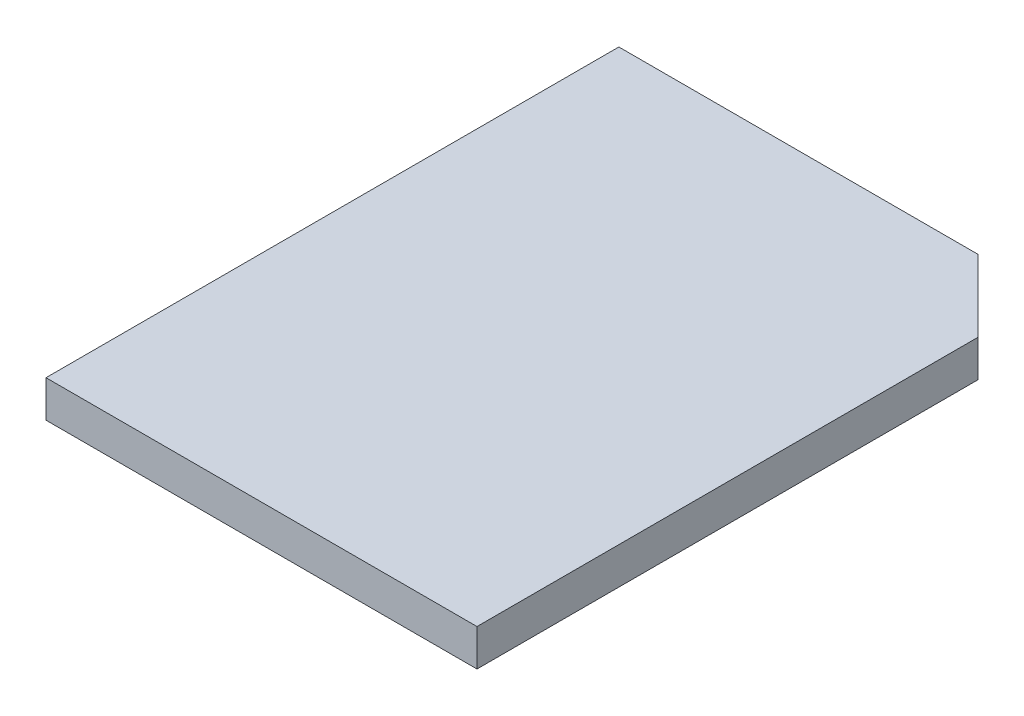
ISO-10303-21;
HEADER;
FILE_DESCRIPTION(('STEP AP214'),'2;1');
FILE_NAME('part.step','',(''),(''),'','','');
FILE_SCHEMA(('AUTOMOTIVE_DESIGN { 1 0 10303 214 1 1 1 1 }'));
ENDSEC;
DATA;
#1=APPLICATION_CONTEXT('core data for automotive mechanical design processes');
#2=APPLICATION_PROTOCOL_DEFINITION('international standard','automotive_design',2000,#1);
#3=PRODUCT_CONTEXT('',#1,'mechanical');
#4=PRODUCT('Part','Part','',(#3));
#5=PRODUCT_RELATED_PRODUCT_CATEGORY('part','',(#4));
#6=PRODUCT_DEFINITION_FORMATION('','',#4);
#7=PRODUCT_DEFINITION_CONTEXT('part definition',#1,'design');
#8=PRODUCT_DEFINITION('design','',#6,#7);
#9=PRODUCT_DEFINITION_SHAPE('','',#8);
#10=(LENGTH_UNIT() NAMED_UNIT(*) SI_UNIT(.MILLI.,.METRE.));
#11=(NAMED_UNIT(*) PLANE_ANGLE_UNIT() SI_UNIT($,.RADIAN.));
#12=(NAMED_UNIT(*) SI_UNIT($,.STERADIAN.) SOLID_ANGLE_UNIT());
#13=UNCERTAINTY_MEASURE_WITH_UNIT(LENGTH_MEASURE(1.E-05),#10,'distance_accuracy_value','');
#14=(GEOMETRIC_REPRESENTATION_CONTEXT(3) GLOBAL_UNCERTAINTY_ASSIGNED_CONTEXT((#13)) GLOBAL_UNIT_ASSIGNED_CONTEXT((#10,
#11,#12)) REPRESENTATION_CONTEXT('',''));
#15=CARTESIAN_POINT('',(0.,0.,0.));
#16=DIRECTION('',(0.,0.,1.));
#17=DIRECTION('',(1.,0.,0.));
#18=AXIS2_PLACEMENT_3D('',#15,#16,#17);
#19=CARTESIAN_POINT('',(0.,2.05,0.));
#20=DIRECTION('',(1.,0.,0.));
#21=DIRECTION('',(0.,0.,-1.));
#22=AXIS2_PLACEMENT_3D('',#19,#20,#21);
#23=PLANE('',#22);
#24=DIRECTION('',(0.,0.,1.));
#25=VECTOR('',#24,1.);
#26=CARTESIAN_POINT('',(0.,0.,0.));
#27=LINE('',#26,#25);
#28=CARTESIAN_POINT('',(0.,0.,-31.9));
#29=VERTEX_POINT('',#28);
#30=CARTESIAN_POINT('',(0.,0.,0.));
#31=VERTEX_POINT('',#30);
#32=EDGE_CURVE('E106',#29,#31,#27,.T.);
#33=ORIENTED_EDGE('',*,*,#32,.T.);
#34=DIRECTION('',(0.,-1.,0.));
#35=VECTOR('',#34,1.);
#36=CARTESIAN_POINT('',(0.,2.05,0.));
#37=LINE('',#36,#35);
#38=CARTESIAN_POINT('',(0.,2.05,0.));
#39=VERTEX_POINT('',#38);
#40=EDGE_CURVE('E11',#39,#31,#37,.T.);
#41=ORIENTED_EDGE('',*,*,#40,.F.);
#42=DIRECTION('',(0.,0.,1.));
#43=VECTOR('',#42,1.);
#44=CARTESIAN_POINT('',(0.,2.05,0.));
#45=LINE('',#44,#43);
#46=CARTESIAN_POINT('',(0.,2.05,-31.9));
#47=VERTEX_POINT('',#46);
#48=EDGE_CURVE('E114',#47,#39,#45,.T.);
#49=ORIENTED_EDGE('',*,*,#48,.F.);
#50=DIRECTION('',(0.,-1.,0.));
#51=VECTOR('',#50,1.);
#52=CARTESIAN_POINT('',(0.,2.05,-31.9));
#53=LINE('',#52,#51);
#54=EDGE_CURVE('E102',#47,#29,#53,.T.);
#55=ORIENTED_EDGE('',*,*,#54,.T.);
#56=EDGE_LOOP('',(#33,#41,#49,#55));
#57=FACE_BOUND('',#56,.T.);
#58=ADVANCED_FACE('F32',(#57),#23,.F.);
#59=CARTESIAN_POINT('',(0.,2.05,0.));
#60=DIRECTION('',(0.,0.,-1.));
#61=DIRECTION('',(-1.,0.,0.));
#62=AXIS2_PLACEMENT_3D('',#59,#60,#61);
#63=PLANE('',#62);
#64=DIRECTION('',(1.,0.,0.));
#65=VECTOR('',#64,1.);
#66=CARTESIAN_POINT('',(0.,0.,0.));
#67=LINE('',#66,#65);
#68=CARTESIAN_POINT('',(24.,0.,0.));
#69=VERTEX_POINT('',#68);
#70=EDGE_CURVE('E109',#31,#69,#67,.T.);
#71=ORIENTED_EDGE('',*,*,#70,.T.);
#72=DIRECTION('',(0.,-1.,0.));
#73=VECTOR('',#72,1.);
#74=CARTESIAN_POINT('',(24.,2.05,0.));
#75=LINE('',#74,#73);
#76=CARTESIAN_POINT('',(24.,2.05,0.));
#77=VERTEX_POINT('',#76);
#78=EDGE_CURVE('E40',#77,#69,#75,.T.);
#79=ORIENTED_EDGE('',*,*,#78,.F.);
#80=DIRECTION('',(1.,0.,0.));
#81=VECTOR('',#80,1.);
#82=CARTESIAN_POINT('',(0.,2.05,0.));
#83=LINE('',#82,#81);
#84=EDGE_CURVE('E82',#39,#77,#83,.T.);
#85=ORIENTED_EDGE('',*,*,#84,.F.);
#86=ORIENTED_EDGE('',*,*,#40,.T.);
#87=EDGE_LOOP('',(#71,#79,#85,#86));
#88=FACE_BOUND('',#87,.T.);
#89=ADVANCED_FACE('F133',(#88),#63,.F.);
#90=CARTESIAN_POINT('',(24.,2.05,0.));
#91=DIRECTION('',(-1.,0.,0.));
#92=DIRECTION('',(0.,0.,1.));
#93=AXIS2_PLACEMENT_3D('',#90,#91,#92);
#94=PLANE('',#93);
#95=DIRECTION('',(0.,0.,-1.));
#96=VECTOR('',#95,1.);
#97=CARTESIAN_POINT('',(24.,0.,0.));
#98=LINE('',#97,#96);
#99=CARTESIAN_POINT('',(24.,0.,-27.9));
#100=VERTEX_POINT('',#99);
#101=EDGE_CURVE('E97',#69,#100,#98,.T.);
#102=ORIENTED_EDGE('',*,*,#101,.T.);
#103=DIRECTION('',(0.,-1.,0.));
#104=VECTOR('',#103,1.);
#105=CARTESIAN_POINT('',(24.,2.05,-27.9));
#106=LINE('',#105,#104);
#107=CARTESIAN_POINT('',(24.,2.05,-27.9));
#108=VERTEX_POINT('',#107);
#109=EDGE_CURVE('E94',#108,#100,#106,.T.);
#110=ORIENTED_EDGE('',*,*,#109,.F.);
#111=DIRECTION('',(0.,0.,-1.));
#112=VECTOR('',#111,1.);
#113=CARTESIAN_POINT('',(24.,2.05,0.));
#114=LINE('',#113,#112);
#115=EDGE_CURVE('E86',#77,#108,#114,.T.);
#116=ORIENTED_EDGE('',*,*,#115,.F.);
#117=ORIENTED_EDGE('',*,*,#78,.T.);
#118=EDGE_LOOP('',(#102,#110,#116,#117));
#119=FACE_BOUND('',#118,.T.);
#120=ADVANCED_FACE('F95',(#119),#94,.F.);
#121=CARTESIAN_POINT('',(20.,2.05,-31.9));
#122=DIRECTION('',(-0.707106781186548,0.,0.707106781186548));
#123=DIRECTION('',(0.707106781186548,0.,0.707106781186548));
#124=AXIS2_PLACEMENT_3D('',#121,#122,#123);
#125=PLANE('',#124);
#126=DIRECTION('',(-0.707106781186548,0.,-0.707106781186548));
#127=VECTOR('',#126,1.);
#128=CARTESIAN_POINT('',(20.,0.,-31.9));
#129=LINE('',#128,#127);
#130=CARTESIAN_POINT('',(20.,0.,-31.9));
#131=VERTEX_POINT('',#130);
#132=EDGE_CURVE('E68',#100,#131,#129,.T.);
#133=ORIENTED_EDGE('',*,*,#132,.T.);
#134=DIRECTION('',(0.,-1.,0.));
#135=VECTOR('',#134,1.);
#136=CARTESIAN_POINT('',(20.,2.05,-31.9));
#137=LINE('',#136,#135);
#138=CARTESIAN_POINT('',(20.,2.05,-31.9));
#139=VERTEX_POINT('',#138);
#140=EDGE_CURVE('E98',#139,#131,#137,.T.);
#141=ORIENTED_EDGE('',*,*,#140,.F.);
#142=DIRECTION('',(-0.707106781186548,0.,-0.707106781186548));
#143=VECTOR('',#142,1.);
#144=CARTESIAN_POINT('',(20.,2.05,-31.9));
#145=LINE('',#144,#143);
#146=EDGE_CURVE('E90',#108,#139,#145,.T.);
#147=ORIENTED_EDGE('',*,*,#146,.F.);
#148=ORIENTED_EDGE('',*,*,#109,.T.);
#149=EDGE_LOOP('',(#133,#141,#147,#148));
#150=FACE_BOUND('',#149,.T.);
#151=ADVANCED_FACE('F100',(#150),#125,.F.);
#152=CARTESIAN_POINT('',(0.,2.05,-31.9));
#153=DIRECTION('',(0.,0.,1.));
#154=DIRECTION('',(1.,0.,0.));
#155=AXIS2_PLACEMENT_3D('',#152,#153,#154);
#156=PLANE('',#155);
#157=DIRECTION('',(-1.,0.,0.));
#158=VECTOR('',#157,1.);
#159=CARTESIAN_POINT('',(0.,0.,-31.9));
#160=LINE('',#159,#158);
#161=EDGE_CURVE('E74',#131,#29,#160,.T.);
#162=ORIENTED_EDGE('',*,*,#161,.T.);
#163=ORIENTED_EDGE('',*,*,#54,.F.);
#164=DIRECTION('',(-1.,0.,0.));
#165=VECTOR('',#164,1.);
#166=CARTESIAN_POINT('',(0.,2.05,-31.9));
#167=LINE('',#166,#165);
#168=EDGE_CURVE('E48',#139,#47,#167,.T.);
#169=ORIENTED_EDGE('',*,*,#168,.F.);
#170=ORIENTED_EDGE('',*,*,#140,.T.);
#171=EDGE_LOOP('',(#162,#163,#169,#170));
#172=FACE_BOUND('',#171,.T.);
#173=ADVANCED_FACE('F122',(#172),#156,.F.);
#174=CARTESIAN_POINT('',(0.,2.05,0.));
#175=DIRECTION('',(0.,-1.,0.));
#176=DIRECTION('',(0.,0.,-1.));
#177=AXIS2_PLACEMENT_3D('',#174,#175,#176);
#178=PLANE('',#177);
#179=ORIENTED_EDGE('',*,*,#48,.T.);
#180=ORIENTED_EDGE('',*,*,#84,.T.);
#181=ORIENTED_EDGE('',*,*,#115,.T.);
#182=ORIENTED_EDGE('',*,*,#146,.T.);
#183=ORIENTED_EDGE('',*,*,#168,.T.);
#184=EDGE_LOOP('',(#179,#180,#181,#182,#183));
#185=FACE_BOUND('',#184,.T.);
#186=ADVANCED_FACE('F88',(#185),#178,.F.);
#187=CARTESIAN_POINT('',(0.,0.,0.));
#188=DIRECTION('',(0.,-1.,0.));
#189=DIRECTION('',(0.,0.,-1.));
#190=AXIS2_PLACEMENT_3D('',#187,#188,#189);
#191=PLANE('',#190);
#192=ORIENTED_EDGE('',*,*,#32,.F.);
#193=ORIENTED_EDGE('',*,*,#161,.F.);
#194=ORIENTED_EDGE('',*,*,#132,.F.);
#195=ORIENTED_EDGE('',*,*,#101,.F.);
#196=ORIENTED_EDGE('',*,*,#70,.F.);
#197=EDGE_LOOP('',(#192,#193,#194,#195,#196));
#198=FACE_BOUND('',#197,.T.);
#199=ADVANCED_FACE('F118',(#198),#191,.T.);
#200=CLOSED_SHELL('',(#58,#89,#120,#151,#173,#186,#199));
#201=MANIFOLD_SOLID_BREP('B2',#200);
#202=ADVANCED_BREP_SHAPE_REPRESENTATION('',(#18,#201),#14);
#203=SHAPE_DEFINITION_REPRESENTATION(#9,#202);
ENDSEC;
END-ISO-10303-21;
